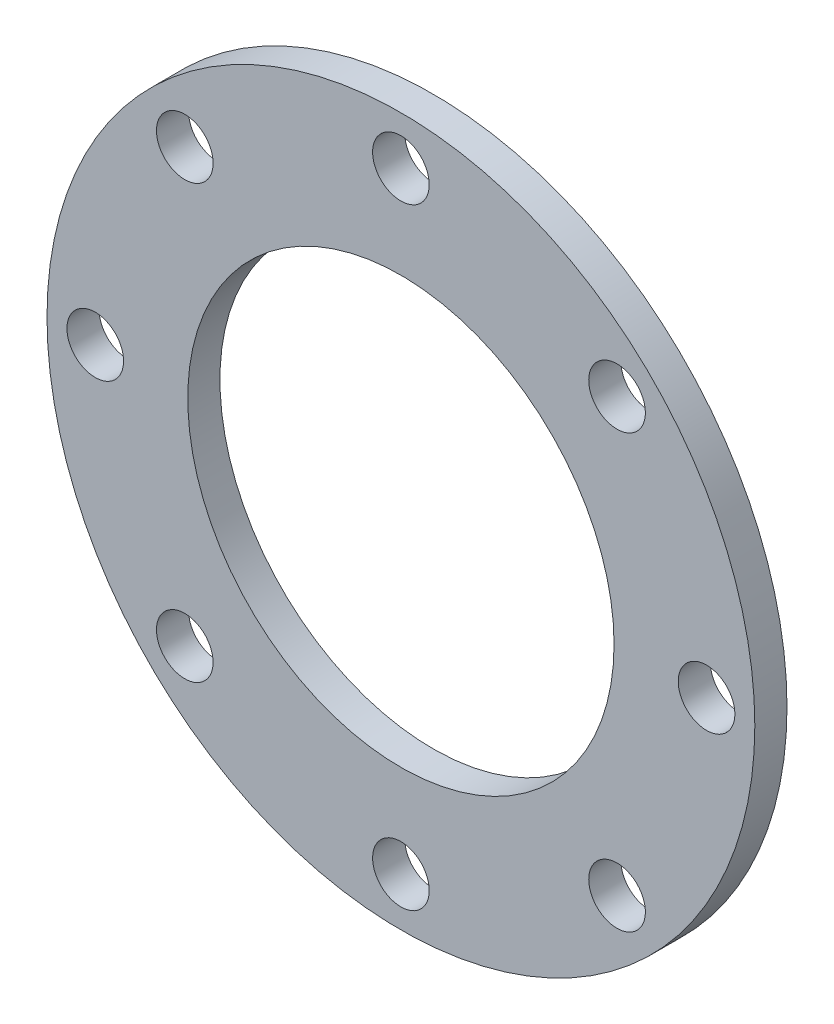
ISO-10303-21;
HEADER;
FILE_DESCRIPTION(('STEP AP214'),'2;1');
FILE_NAME('part.step','',(''),(''),'','','');
FILE_SCHEMA(('AUTOMOTIVE_DESIGN { 1 0 10303 214 1 1 1 1 }'));
ENDSEC;
DATA;
#1=APPLICATION_CONTEXT('core data for automotive mechanical design processes');
#2=APPLICATION_PROTOCOL_DEFINITION('international standard','automotive_design',2000,#1);
#3=PRODUCT_CONTEXT('',#1,'mechanical');
#4=PRODUCT('Part','Part','',(#3));
#5=PRODUCT_RELATED_PRODUCT_CATEGORY('part','',(#4));
#6=PRODUCT_DEFINITION_FORMATION('','',#4);
#7=PRODUCT_DEFINITION_CONTEXT('part definition',#1,'design');
#8=PRODUCT_DEFINITION('design','',#6,#7);
#9=PRODUCT_DEFINITION_SHAPE('','',#8);
#10=(LENGTH_UNIT() NAMED_UNIT(*) SI_UNIT(.MILLI.,.METRE.));
#11=(NAMED_UNIT(*) PLANE_ANGLE_UNIT() SI_UNIT($,.RADIAN.));
#12=(NAMED_UNIT(*) SI_UNIT($,.STERADIAN.) SOLID_ANGLE_UNIT());
#13=UNCERTAINTY_MEASURE_WITH_UNIT(LENGTH_MEASURE(1.E-05),#10,'distance_accuracy_value','');
#14=(GEOMETRIC_REPRESENTATION_CONTEXT(3) GLOBAL_UNCERTAINTY_ASSIGNED_CONTEXT((#13)) GLOBAL_UNIT_ASSIGNED_CONTEXT((#10,
#11,#12)) REPRESENTATION_CONTEXT('',''));
#15=CARTESIAN_POINT('',(0.,0.,0.));
#16=DIRECTION('',(0.,0.,1.));
#17=DIRECTION('',(1.,0.,0.));
#18=AXIS2_PLACEMENT_3D('',#15,#16,#17);
#19=CARTESIAN_POINT('',(0.,0.,12.7));
#20=DIRECTION('',(0.,0.,1.));
#21=DIRECTION('',(1.,0.,0.));
#22=AXIS2_PLACEMENT_3D('',#19,#20,#21);
#23=PLANE('',#22);
#24=CARTESIAN_POINT('',(-4.28186117435331E-13,120.65,12.7));
#25=DIRECTION('',(0.,0.,1.));
#26=DIRECTION('',(0.,1.,0.));
#27=AXIS2_PLACEMENT_3D('',#24,#25,#26);
#28=CIRCLE('',#27,11.176);
#29=CARTESIAN_POINT('',(-4.67206912878242E-13,131.826,12.7));
#30=VERTEX_POINT('',#29);
#31=EDGE_CURVE('E75',#30,#30,#28,.T.);
#32=ORIENTED_EDGE('',*,*,#31,.F.);
#33=EDGE_LOOP('',(#32));
#34=FACE_BOUND('',#33,.T.);
#35=CARTESIAN_POINT('',(-85.3124331501574,85.3124331501565,12.7));
#36=DIRECTION('',(0.,0.,1.));
#37=DIRECTION('',(-0.707106781186551,0.707106781186544,0.));
#38=AXIS2_PLACEMENT_3D('',#35,#36,#37);
#39=CIRCLE('',#38,11.176);
#40=CARTESIAN_POINT('',(-93.2150585366983,93.2150585366973,12.7));
#41=VERTEX_POINT('',#40);
#42=EDGE_CURVE('E94',#41,#41,#39,.T.);
#43=ORIENTED_EDGE('',*,*,#42,.F.);
#44=EDGE_LOOP('',(#43));
#45=FACE_BOUND('',#44,.T.);
#46=CARTESIAN_POINT('',(-120.65,0.,12.7));
#47=DIRECTION('',(0.,0.,1.));
#48=DIRECTION('',(-1.,0.,0.));
#49=AXIS2_PLACEMENT_3D('',#46,#47,#48);
#50=CIRCLE('',#49,11.176);
#51=CARTESIAN_POINT('',(-131.826,0.,12.7));
#52=VERTEX_POINT('',#51);
#53=EDGE_CURVE('E86',#52,#52,#50,.T.);
#54=ORIENTED_EDGE('',*,*,#53,.F.);
#55=EDGE_LOOP('',(#54));
#56=FACE_BOUND('',#55,.T.);
#57=CARTESIAN_POINT('',(-85.3124331501562,-85.3124331501577,12.7));
#58=DIRECTION('',(0.,0.,1.));
#59=DIRECTION('',(-0.707106781186541,-0.707106781186554,0.));
#60=AXIS2_PLACEMENT_3D('',#57,#58,#59);
#61=CIRCLE('',#60,11.176);
#62=CARTESIAN_POINT('',(-93.215058536697,-93.2150585366986,12.7));
#63=VERTEX_POINT('',#62);
#64=EDGE_CURVE('E76',#63,#63,#61,.T.);
#65=ORIENTED_EDGE('',*,*,#64,.F.);
#66=EDGE_LOOP('',(#65));
#67=FACE_BOUND('',#66,.T.);
#68=CARTESIAN_POINT('',(1.27068056449818E-12,-120.65,12.7));
#69=DIRECTION('',(0.,0.,1.));
#70=DIRECTION('',(0.,-1.,0.));
#71=AXIS2_PLACEMENT_3D('',#68,#69,#70);
#72=CIRCLE('',#71,11.176);
#73=CARTESIAN_POINT('',(1.38774295082691E-12,-131.826,12.7));
#74=VERTEX_POINT('',#73);
#75=EDGE_CURVE('E85',#74,#74,#72,.T.);
#76=ORIENTED_EDGE('',*,*,#75,.F.);
#77=EDGE_LOOP('',(#76));
#78=FACE_BOUND('',#77,.T.);
#79=CARTESIAN_POINT('',(85.312433150158,-85.3124331501559,12.7));
#80=DIRECTION('',(0.,0.,1.));
#81=DIRECTION('',(0.707106781186556,-0.707106781186539,0.));
#82=AXIS2_PLACEMENT_3D('',#79,#80,#81);
#83=CIRCLE('',#82,11.176);
#84=CARTESIAN_POINT('',(93.2150585366989,-93.2150585366967,12.7));
#85=VERTEX_POINT('',#84);
#86=EDGE_CURVE('E108',#85,#85,#83,.T.);
#87=ORIENTED_EDGE('',*,*,#86,.F.);
#88=EDGE_LOOP('',(#87));
#89=FACE_BOUND('',#88,.T.);
#90=CARTESIAN_POINT('',(85.3124331501568,85.3124331501571,12.7));
#91=DIRECTION('',(0.,0.,1.));
#92=DIRECTION('',(0.707106781186546,0.707106781186549,0.));
#93=AXIS2_PLACEMENT_3D('',#90,#91,#92);
#94=CIRCLE('',#93,11.176);
#95=CARTESIAN_POINT('',(93.2150585366977,93.215058536698,12.7));
#96=VERTEX_POINT('',#95);
#97=EDGE_CURVE('E67',#96,#96,#94,.T.);
#98=ORIENTED_EDGE('',*,*,#97,.F.);
#99=EDGE_LOOP('',(#98));
#100=FACE_BOUND('',#99,.T.);
#101=CARTESIAN_POINT('',(120.65,0.,12.7));
#102=DIRECTION('',(0.,0.,1.));
#103=DIRECTION('',(1.,0.,0.));
#104=AXIS2_PLACEMENT_3D('',#101,#102,#103);
#105=CIRCLE('',#104,11.176);
#106=CARTESIAN_POINT('',(131.826,0.,12.7));
#107=VERTEX_POINT('',#106);
#108=EDGE_CURVE('E63',#107,#107,#105,.T.);
#109=ORIENTED_EDGE('',*,*,#108,.F.);
#110=EDGE_LOOP('',(#109));
#111=FACE_BOUND('',#110,.T.);
#112=CARTESIAN_POINT('',(0.,0.,12.7));
#113=DIRECTION('',(0.,0.,1.));
#114=DIRECTION('',(1.,0.,0.));
#115=AXIS2_PLACEMENT_3D('',#112,#113,#114);
#116=CIRCLE('',#115,139.7);
#117=CARTESIAN_POINT('',(139.7,0.,12.7));
#118=VERTEX_POINT('',#117);
#119=EDGE_CURVE('E10',#118,#118,#116,.T.);
#120=ORIENTED_EDGE('',*,*,#119,.T.);
#121=EDGE_LOOP('',(#120));
#122=FACE_BOUND('',#121,.T.);
#123=CARTESIAN_POINT('',(0.,0.,12.7));
#124=DIRECTION('',(0.,0.,1.));
#125=DIRECTION('',(1.,0.,0.));
#126=AXIS2_PLACEMENT_3D('',#123,#124,#125);
#127=CIRCLE('',#126,84.1375);
#128=CARTESIAN_POINT('',(84.1375,0.,12.7));
#129=VERTEX_POINT('',#128);
#130=EDGE_CURVE('E50',#129,#129,#127,.T.);
#131=ORIENTED_EDGE('',*,*,#130,.F.);
#132=EDGE_LOOP('',(#131));
#133=FACE_BOUND('',#132,.T.);
#134=ADVANCED_FACE('F37',(#34,#45,#56,#67,#78,#89,#100,#111,#122,#133),#23,.T.);
#135=CARTESIAN_POINT('',(0.,0.,0.));
#136=DIRECTION('',(0.,0.,1.));
#137=DIRECTION('',(1.,0.,0.));
#138=AXIS2_PLACEMENT_3D('',#135,#136,#137);
#139=PLANE('',#138);
#140=CARTESIAN_POINT('',(-4.28186117435331E-13,120.65,0.));
#141=DIRECTION('',(0.,0.,1.));
#142=DIRECTION('',(0.,1.,0.));
#143=AXIS2_PLACEMENT_3D('',#140,#141,#142);
#144=CIRCLE('',#143,11.176);
#145=CARTESIAN_POINT('',(-4.67206912878242E-13,131.826,0.));
#146=VERTEX_POINT('',#145);
#147=EDGE_CURVE('E98',#146,#146,#144,.T.);
#148=ORIENTED_EDGE('',*,*,#147,.T.);
#149=EDGE_LOOP('',(#148));
#150=FACE_BOUND('',#149,.T.);
#151=CARTESIAN_POINT('',(-85.3124331501574,85.3124331501565,0.));
#152=DIRECTION('',(0.,0.,1.));
#153=DIRECTION('',(-0.707106781186551,0.707106781186544,0.));
#154=AXIS2_PLACEMENT_3D('',#151,#152,#153);
#155=CIRCLE('',#154,11.176);
#156=CARTESIAN_POINT('',(-93.2150585366983,93.2150585366973,0.));
#157=VERTEX_POINT('',#156);
#158=EDGE_CURVE('E90',#157,#157,#155,.T.);
#159=ORIENTED_EDGE('',*,*,#158,.T.);
#160=EDGE_LOOP('',(#159));
#161=FACE_BOUND('',#160,.T.);
#162=CARTESIAN_POINT('',(-120.65,0.,0.));
#163=DIRECTION('',(0.,0.,1.));
#164=DIRECTION('',(-1.,0.,0.));
#165=AXIS2_PLACEMENT_3D('',#162,#163,#164);
#166=CIRCLE('',#165,11.176);
#167=CARTESIAN_POINT('',(-131.826,0.,0.));
#168=VERTEX_POINT('',#167);
#169=EDGE_CURVE('E80',#168,#168,#166,.T.);
#170=ORIENTED_EDGE('',*,*,#169,.T.);
#171=EDGE_LOOP('',(#170));
#172=FACE_BOUND('',#171,.T.);
#173=CARTESIAN_POINT('',(-85.3124331501562,-85.3124331501577,0.));
#174=DIRECTION('',(0.,0.,1.));
#175=DIRECTION('',(-0.707106781186541,-0.707106781186554,0.));
#176=AXIS2_PLACEMENT_3D('',#173,#174,#175);
#177=CIRCLE('',#176,11.176);
#178=CARTESIAN_POINT('',(-93.215058536697,-93.2150585366986,0.));
#179=VERTEX_POINT('',#178);
#180=EDGE_CURVE('E81',#179,#179,#177,.T.);
#181=ORIENTED_EDGE('',*,*,#180,.T.);
#182=EDGE_LOOP('',(#181));
#183=FACE_BOUND('',#182,.T.);
#184=CARTESIAN_POINT('',(1.27068056449818E-12,-120.65,0.));
#185=DIRECTION('',(0.,0.,1.));
#186=DIRECTION('',(0.,-1.,0.));
#187=AXIS2_PLACEMENT_3D('',#184,#185,#186);
#188=CIRCLE('',#187,11.176);
#189=CARTESIAN_POINT('',(1.38774295082691E-12,-131.826,0.));
#190=VERTEX_POINT('',#189);
#191=EDGE_CURVE('E112',#190,#190,#188,.T.);
#192=ORIENTED_EDGE('',*,*,#191,.T.);
#193=EDGE_LOOP('',(#192));
#194=FACE_BOUND('',#193,.T.);
#195=CARTESIAN_POINT('',(85.312433150158,-85.3124331501559,0.));
#196=DIRECTION('',(0.,0.,1.));
#197=DIRECTION('',(0.707106781186556,-0.707106781186539,0.));
#198=AXIS2_PLACEMENT_3D('',#195,#196,#197);
#199=CIRCLE('',#198,11.176);
#200=CARTESIAN_POINT('',(93.2150585366989,-93.2150585366967,0.));
#201=VERTEX_POINT('',#200);
#202=EDGE_CURVE('E113',#201,#201,#199,.T.);
#203=ORIENTED_EDGE('',*,*,#202,.T.);
#204=EDGE_LOOP('',(#203));
#205=FACE_BOUND('',#204,.T.);
#206=CARTESIAN_POINT('',(85.3124331501568,85.3124331501571,0.));
#207=DIRECTION('',(0.,0.,1.));
#208=DIRECTION('',(0.707106781186546,0.707106781186549,0.));
#209=AXIS2_PLACEMENT_3D('',#206,#207,#208);
#210=CIRCLE('',#209,11.176);
#211=CARTESIAN_POINT('',(93.2150585366977,93.215058536698,0.));
#212=VERTEX_POINT('',#211);
#213=EDGE_CURVE('E71',#212,#212,#210,.T.);
#214=ORIENTED_EDGE('',*,*,#213,.T.);
#215=EDGE_LOOP('',(#214));
#216=FACE_BOUND('',#215,.T.);
#217=CARTESIAN_POINT('',(120.65,0.,0.));
#218=DIRECTION('',(0.,0.,1.));
#219=DIRECTION('',(1.,0.,0.));
#220=AXIS2_PLACEMENT_3D('',#217,#218,#219);
#221=CIRCLE('',#220,11.176);
#222=CARTESIAN_POINT('',(131.826,0.,0.));
#223=VERTEX_POINT('',#222);
#224=EDGE_CURVE('E56',#223,#223,#221,.T.);
#225=ORIENTED_EDGE('',*,*,#224,.T.);
#226=EDGE_LOOP('',(#225));
#227=FACE_BOUND('',#226,.T.);
#228=CARTESIAN_POINT('',(0.,0.,0.));
#229=DIRECTION('',(0.,0.,1.));
#230=DIRECTION('',(1.,0.,0.));
#231=AXIS2_PLACEMENT_3D('',#228,#229,#230);
#232=CIRCLE('',#231,139.7);
#233=CARTESIAN_POINT('',(139.7,0.,0.));
#234=VERTEX_POINT('',#233);
#235=EDGE_CURVE('E41',#234,#234,#232,.T.);
#236=ORIENTED_EDGE('',*,*,#235,.F.);
#237=EDGE_LOOP('',(#236));
#238=FACE_BOUND('',#237,.T.);
#239=CARTESIAN_POINT('',(0.,0.,0.));
#240=DIRECTION('',(0.,0.,1.));
#241=DIRECTION('',(1.,0.,0.));
#242=AXIS2_PLACEMENT_3D('',#239,#240,#241);
#243=CIRCLE('',#242,84.1375);
#244=CARTESIAN_POINT('',(84.1375,0.,0.));
#245=VERTEX_POINT('',#244);
#246=EDGE_CURVE('E52',#245,#245,#243,.T.);
#247=ORIENTED_EDGE('',*,*,#246,.T.);
#248=EDGE_LOOP('',(#247));
#249=FACE_BOUND('',#248,.T.);
#250=ADVANCED_FACE('F124',(#150,#161,#172,#183,#194,#205,#216,#227,#238,#249),#139,.F.);
#251=CARTESIAN_POINT('',(0.,0.,12.7));
#252=DIRECTION('',(0.,0.,-1.));
#253=DIRECTION('',(-1.,0.,0.));
#254=AXIS2_PLACEMENT_3D('',#251,#252,#253);
#255=CYLINDRICAL_SURFACE('',#254,139.7);
#256=ORIENTED_EDGE('',*,*,#119,.F.);
#257=EDGE_LOOP('',(#256));
#258=FACE_BOUND('',#257,.T.);
#259=ORIENTED_EDGE('',*,*,#235,.T.);
#260=EDGE_LOOP('',(#259));
#261=FACE_BOUND('',#260,.T.);
#262=ADVANCED_FACE('F39',(#258,#261),#255,.T.);
#263=CARTESIAN_POINT('',(0.,0.,12.7));
#264=DIRECTION('',(0.,0.,-1.));
#265=DIRECTION('',(-1.,0.,0.));
#266=AXIS2_PLACEMENT_3D('',#263,#264,#265);
#267=CYLINDRICAL_SURFACE('',#266,84.1375);
#268=ORIENTED_EDGE('',*,*,#130,.T.);
#269=EDGE_LOOP('',(#268));
#270=FACE_BOUND('',#269,.T.);
#271=ORIENTED_EDGE('',*,*,#246,.F.);
#272=EDGE_LOOP('',(#271));
#273=FACE_BOUND('',#272,.T.);
#274=ADVANCED_FACE('F147',(#270,#273),#267,.F.);
#275=CARTESIAN_POINT('',(120.65,0.,12.7));
#276=DIRECTION('',(0.,0.,1.));
#277=DIRECTION('',(1.,0.,0.));
#278=AXIS2_PLACEMENT_3D('',#275,#276,#277);
#279=CYLINDRICAL_SURFACE('',#278,11.176);
#280=ORIENTED_EDGE('',*,*,#224,.F.);
#281=EDGE_LOOP('',(#280));
#282=FACE_BOUND('',#281,.T.);
#283=ORIENTED_EDGE('',*,*,#108,.T.);
#284=EDGE_LOOP('',(#283));
#285=FACE_BOUND('',#284,.T.);
#286=ADVANCED_FACE('F150',(#282,#285),#279,.F.);
#287=CARTESIAN_POINT('',(85.3124331501568,85.3124331501571,12.7));
#288=DIRECTION('',(0.,0.,1.));
#289=DIRECTION('',(0.707106781186546,0.707106781186549,0.));
#290=AXIS2_PLACEMENT_3D('',#287,#288,#289);
#291=CYLINDRICAL_SURFACE('',#290,11.176);
#292=ORIENTED_EDGE('',*,*,#213,.F.);
#293=EDGE_LOOP('',(#292));
#294=FACE_BOUND('',#293,.T.);
#295=ORIENTED_EDGE('',*,*,#97,.T.);
#296=EDGE_LOOP('',(#295));
#297=FACE_BOUND('',#296,.T.);
#298=ADVANCED_FACE('F164',(#294,#297),#291,.F.);
#299=CARTESIAN_POINT('',(85.312433150158,-85.3124331501559,12.7));
#300=DIRECTION('',(0.,0.,1.));
#301=DIRECTION('',(0.707106781186556,-0.707106781186539,0.));
#302=AXIS2_PLACEMENT_3D('',#299,#300,#301);
#303=CYLINDRICAL_SURFACE('',#302,11.176);
#304=ORIENTED_EDGE('',*,*,#202,.F.);
#305=EDGE_LOOP('',(#304));
#306=FACE_BOUND('',#305,.T.);
#307=ORIENTED_EDGE('',*,*,#86,.T.);
#308=EDGE_LOOP('',(#307));
#309=FACE_BOUND('',#308,.T.);
#310=ADVANCED_FACE('F131',(#306,#309),#303,.F.);
#311=CARTESIAN_POINT('',(1.27068056449818E-12,-120.65,12.7));
#312=DIRECTION('',(0.,0.,1.));
#313=DIRECTION('',(0.,-1.,0.));
#314=AXIS2_PLACEMENT_3D('',#311,#312,#313);
#315=CYLINDRICAL_SURFACE('',#314,11.176);
#316=ORIENTED_EDGE('',*,*,#191,.F.);
#317=EDGE_LOOP('',(#316));
#318=FACE_BOUND('',#317,.T.);
#319=ORIENTED_EDGE('',*,*,#75,.T.);
#320=EDGE_LOOP('',(#319));
#321=FACE_BOUND('',#320,.T.);
#322=ADVANCED_FACE('F127',(#318,#321),#315,.F.);
#323=CARTESIAN_POINT('',(-85.3124331501562,-85.3124331501577,12.7));
#324=DIRECTION('',(0.,0.,1.));
#325=DIRECTION('',(-0.707106781186541,-0.707106781186554,0.));
#326=AXIS2_PLACEMENT_3D('',#323,#324,#325);
#327=CYLINDRICAL_SURFACE('',#326,11.176);
#328=ORIENTED_EDGE('',*,*,#180,.F.);
#329=EDGE_LOOP('',(#328));
#330=FACE_BOUND('',#329,.T.);
#331=ORIENTED_EDGE('',*,*,#64,.T.);
#332=EDGE_LOOP('',(#331));
#333=FACE_BOUND('',#332,.T.);
#334=ADVANCED_FACE('F130',(#330,#333),#327,.F.);
#335=CARTESIAN_POINT('',(-120.65,0.,12.7));
#336=DIRECTION('',(0.,0.,1.));
#337=DIRECTION('',(-1.,0.,0.));
#338=AXIS2_PLACEMENT_3D('',#335,#336,#337);
#339=CYLINDRICAL_SURFACE('',#338,11.176);
#340=ORIENTED_EDGE('',*,*,#169,.F.);
#341=EDGE_LOOP('',(#340));
#342=FACE_BOUND('',#341,.T.);
#343=ORIENTED_EDGE('',*,*,#53,.T.);
#344=EDGE_LOOP('',(#343));
#345=FACE_BOUND('',#344,.T.);
#346=ADVANCED_FACE('F171',(#342,#345),#339,.F.);
#347=CARTESIAN_POINT('',(-85.3124331501574,85.3124331501565,12.7));
#348=DIRECTION('',(0.,0.,1.));
#349=DIRECTION('',(-0.707106781186551,0.707106781186544,0.));
#350=AXIS2_PLACEMENT_3D('',#347,#348,#349);
#351=CYLINDRICAL_SURFACE('',#350,11.176);
#352=ORIENTED_EDGE('',*,*,#158,.F.);
#353=EDGE_LOOP('',(#352));
#354=FACE_BOUND('',#353,.T.);
#355=ORIENTED_EDGE('',*,*,#42,.T.);
#356=EDGE_LOOP('',(#355));
#357=FACE_BOUND('',#356,.T.);
#358=ADVANCED_FACE('F175',(#354,#357),#351,.F.);
#359=CARTESIAN_POINT('',(-4.28186117435331E-13,120.65,12.7));
#360=DIRECTION('',(0.,0.,1.));
#361=DIRECTION('',(0.,1.,0.));
#362=AXIS2_PLACEMENT_3D('',#359,#360,#361);
#363=CYLINDRICAL_SURFACE('',#362,11.176);
#364=ORIENTED_EDGE('',*,*,#147,.F.);
#365=EDGE_LOOP('',(#364));
#366=FACE_BOUND('',#365,.T.);
#367=ORIENTED_EDGE('',*,*,#31,.T.);
#368=EDGE_LOOP('',(#367));
#369=FACE_BOUND('',#368,.T.);
#370=ADVANCED_FACE('F179',(#366,#369),#363,.F.);
#371=CLOSED_SHELL('',(#134,#250,#262,#274,#286,#298,#310,#322,#334,#346,#358,#370));
#372=MANIFOLD_SOLID_BREP('B2',#371);
#373=ADVANCED_BREP_SHAPE_REPRESENTATION('',(#18,#372),#14);
#374=SHAPE_DEFINITION_REPRESENTATION(#9,#373);
ENDSEC;
END-ISO-10303-21;
